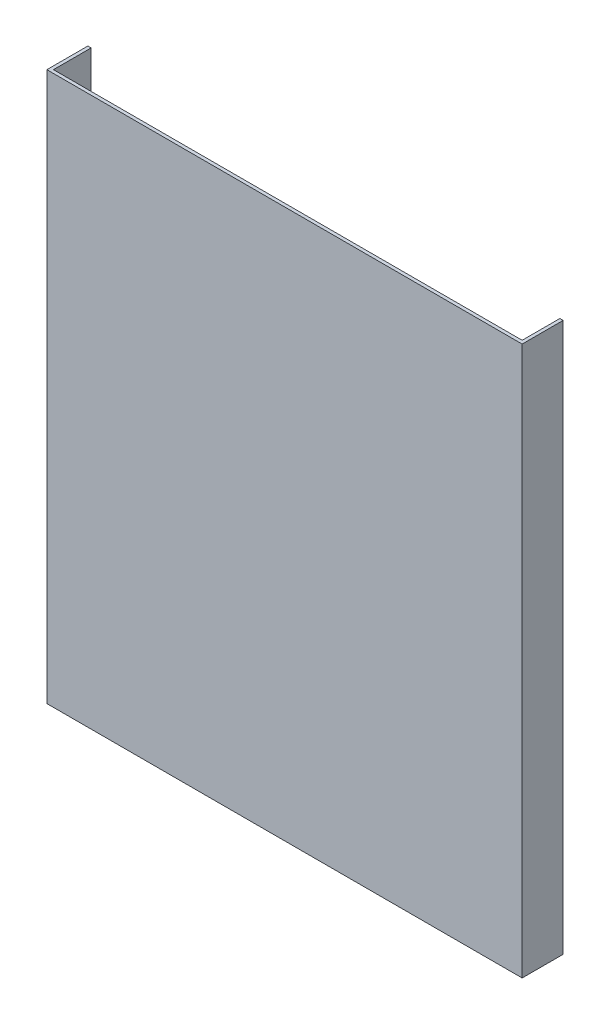
ISO-10303-21;
HEADER;
FILE_DESCRIPTION(('STEP AP214'),'2;1');
FILE_NAME('part.step','',(''),(''),'','','');
FILE_SCHEMA(('AUTOMOTIVE_DESIGN { 1 0 10303 214 1 1 1 1 }'));
ENDSEC;
DATA;
#1=APPLICATION_CONTEXT('core data for automotive mechanical design processes');
#2=APPLICATION_PROTOCOL_DEFINITION('international standard','automotive_design',2000,#1);
#3=PRODUCT_CONTEXT('',#1,'mechanical');
#4=PRODUCT('Part','Part','',(#3));
#5=PRODUCT_RELATED_PRODUCT_CATEGORY('part','',(#4));
#6=PRODUCT_DEFINITION_FORMATION('','',#4);
#7=PRODUCT_DEFINITION_CONTEXT('part definition',#1,'design');
#8=PRODUCT_DEFINITION('design','',#6,#7);
#9=PRODUCT_DEFINITION_SHAPE('','',#8);
#10=(LENGTH_UNIT() NAMED_UNIT(*) SI_UNIT(.MILLI.,.METRE.));
#11=(NAMED_UNIT(*) PLANE_ANGLE_UNIT() SI_UNIT($,.RADIAN.));
#12=(NAMED_UNIT(*) SI_UNIT($,.STERADIAN.) SOLID_ANGLE_UNIT());
#13=UNCERTAINTY_MEASURE_WITH_UNIT(LENGTH_MEASURE(1.E-05),#10,'distance_accuracy_value','');
#14=(GEOMETRIC_REPRESENTATION_CONTEXT(3) GLOBAL_UNCERTAINTY_ASSIGNED_CONTEXT((#13)) GLOBAL_UNIT_ASSIGNED_CONTEXT((#10,
#11,#12)) REPRESENTATION_CONTEXT('',''));
#15=CARTESIAN_POINT('',(0.,0.,0.));
#16=DIRECTION('',(0.,0.,1.));
#17=DIRECTION('',(1.,0.,0.));
#18=AXIS2_PLACEMENT_3D('',#15,#16,#17);
#19=CARTESIAN_POINT('',(0.,0.,0.));
#20=DIRECTION('',(0.,0.,1.));
#21=DIRECTION('',(1.,0.,0.));
#22=AXIS2_PLACEMENT_3D('',#19,#20,#21);
#23=PLANE('',#22);
#24=DIRECTION('',(0.,1.,0.));
#25=VECTOR('',#24,1.);
#26=CARTESIAN_POINT('',(174.409495548961,-273.041543026706,0.));
#27=LINE('',#26,#25);
#28=CARTESIAN_POINT('',(174.409495548961,-273.041543026706,0.));
#29=VERTEX_POINT('',#28);
#30=CARTESIAN_POINT('',(174.409495548961,61.9584569732937,0.));
#31=VERTEX_POINT('',#30);
#32=EDGE_CURVE('E129',#29,#31,#27,.T.);
#33=ORIENTED_EDGE('',*,*,#32,.F.);
#34=DIRECTION('',(1.,0.,0.));
#35=VECTOR('',#34,1.);
#36=CARTESIAN_POINT('',(-113.590504451039,-273.041543026706,0.));
#37=LINE('',#36,#35);
#38=CARTESIAN_POINT('',(-111.590504451039,-273.041543026706,0.));
#39=VERTEX_POINT('',#38);
#40=EDGE_CURVE('E168',#39,#29,#37,.T.);
#41=ORIENTED_EDGE('',*,*,#40,.F.);
#42=DIRECTION('',(0.,-1.,0.));
#43=VECTOR('',#42,1.);
#44=CARTESIAN_POINT('',(-111.590504451039,61.9584569732937,0.));
#45=LINE('',#44,#43);
#46=CARTESIAN_POINT('',(-111.590504451039,61.9584569732937,0.));
#47=VERTEX_POINT('',#46);
#48=EDGE_CURVE('E142',#47,#39,#45,.T.);
#49=ORIENTED_EDGE('',*,*,#48,.F.);
#50=DIRECTION('',(-1.,0.,0.));
#51=VECTOR('',#50,1.);
#52=CARTESIAN_POINT('',(-113.590504451039,61.9584569732937,0.));
#53=LINE('',#52,#51);
#54=EDGE_CURVE('E60',#31,#47,#53,.T.);
#55=ORIENTED_EDGE('',*,*,#54,.F.);
#56=EDGE_LOOP('',(#33,#41,#49,#55));
#57=FACE_BOUND('',#56,.T.);
#58=ADVANCED_FACE('F39',(#57),#23,.F.);
#59=CARTESIAN_POINT('',(-113.590504451039,61.9584569732937,2.));
#60=DIRECTION('',(1.,0.,0.));
#61=DIRECTION('',(0.,1.,0.));
#62=AXIS2_PLACEMENT_3D('',#59,#60,#61);
#63=PLANE('',#62);
#64=DIRECTION('',(0.,0.,-1.));
#65=VECTOR('',#64,1.);
#66=CARTESIAN_POINT('',(-113.590504451039,61.9584569732937,2.));
#67=LINE('',#66,#65);
#68=CARTESIAN_POINT('',(-113.590504451039,61.9584569732937,2.));
#69=VERTEX_POINT('',#68);
#70=CARTESIAN_POINT('',(-113.590504451039,61.9584569732937,-23.));
#71=VERTEX_POINT('',#70);
#72=EDGE_CURVE('E181',#69,#71,#67,.T.);
#73=ORIENTED_EDGE('',*,*,#72,.T.);
#74=DIRECTION('',(0.,1.,0.));
#75=VECTOR('',#74,1.);
#76=CARTESIAN_POINT('',(-113.590504451039,61.9584569732937,-23.));
#77=LINE('',#76,#75);
#78=CARTESIAN_POINT('',(-113.590504451039,-273.041543026706,-23.));
#79=VERTEX_POINT('',#78);
#80=EDGE_CURVE('E143',#79,#71,#77,.T.);
#81=ORIENTED_EDGE('',*,*,#80,.F.);
#82=DIRECTION('',(0.,0.,-1.));
#83=VECTOR('',#82,1.);
#84=CARTESIAN_POINT('',(-113.590504451039,-273.041543026706,2.));
#85=LINE('',#84,#83);
#86=CARTESIAN_POINT('',(-113.590504451039,-273.041543026706,2.));
#87=VERTEX_POINT('',#86);
#88=EDGE_CURVE('E11',#87,#79,#85,.T.);
#89=ORIENTED_EDGE('',*,*,#88,.F.);
#90=DIRECTION('',(0.,-1.,0.));
#91=VECTOR('',#90,1.);
#92=CARTESIAN_POINT('',(-113.590504451039,61.9584569732937,2.));
#93=LINE('',#92,#91);
#94=EDGE_CURVE('E169',#69,#87,#93,.T.);
#95=ORIENTED_EDGE('',*,*,#94,.F.);
#96=EDGE_LOOP('',(#73,#81,#89,#95));
#97=FACE_BOUND('',#96,.T.);
#98=ADVANCED_FACE('F41',(#97),#63,.F.);
#99=CARTESIAN_POINT('',(-113.590504451039,-273.041543026706,2.));
#100=DIRECTION('',(0.,1.,0.));
#101=DIRECTION('',(0.,0.,1.));
#102=AXIS2_PLACEMENT_3D('',#99,#100,#101);
#103=PLANE('',#102);
#104=ORIENTED_EDGE('',*,*,#88,.T.);
#105=DIRECTION('',(-1.,0.,0.));
#106=VECTOR('',#105,1.);
#107=CARTESIAN_POINT('',(-113.590504451039,-273.041543026706,-23.));
#108=LINE('',#107,#106);
#109=CARTESIAN_POINT('',(-111.590504451039,-273.041543026706,-23.));
#110=VERTEX_POINT('',#109);
#111=EDGE_CURVE('E153',#110,#79,#108,.T.);
#112=ORIENTED_EDGE('',*,*,#111,.F.);
#113=DIRECTION('',(0.,0.,1.));
#114=VECTOR('',#113,1.);
#115=CARTESIAN_POINT('',(-111.590504451039,-273.041543026706,-23.));
#116=LINE('',#115,#114);
#117=EDGE_CURVE('E157',#110,#39,#116,.T.);
#118=ORIENTED_EDGE('',*,*,#117,.T.);
#119=ORIENTED_EDGE('',*,*,#40,.T.);
#120=DIRECTION('',(0.,0.,1.));
#121=VECTOR('',#120,1.);
#122=CARTESIAN_POINT('',(174.409495548961,-273.041543026706,-23.));
#123=LINE('',#122,#121);
#124=CARTESIAN_POINT('',(174.409495548961,-273.041543026706,-23.));
#125=VERTEX_POINT('',#124);
#126=EDGE_CURVE('E119',#125,#29,#123,.T.);
#127=ORIENTED_EDGE('',*,*,#126,.F.);
#128=DIRECTION('',(-1.,0.,0.));
#129=VECTOR('',#128,1.);
#130=CARTESIAN_POINT('',(176.409495548961,-273.041543026706,-23.));
#131=LINE('',#130,#129);
#132=CARTESIAN_POINT('',(176.409495548961,-273.041543026706,-23.));
#133=VERTEX_POINT('',#132);
#134=EDGE_CURVE('E116',#133,#125,#131,.T.);
#135=ORIENTED_EDGE('',*,*,#134,.F.);
#136=DIRECTION('',(0.,0.,-1.));
#137=VECTOR('',#136,1.);
#138=CARTESIAN_POINT('',(176.409495548961,-273.041543026706,2.));
#139=LINE('',#138,#137);
#140=CARTESIAN_POINT('',(176.409495548961,-273.041543026706,2.));
#141=VERTEX_POINT('',#140);
#142=EDGE_CURVE('E48',#141,#133,#139,.T.);
#143=ORIENTED_EDGE('',*,*,#142,.F.);
#144=DIRECTION('',(1.,0.,0.));
#145=VECTOR('',#144,1.);
#146=CARTESIAN_POINT('',(-113.590504451039,-273.041543026706,2.));
#147=LINE('',#146,#145);
#148=EDGE_CURVE('E173',#87,#141,#147,.T.);
#149=ORIENTED_EDGE('',*,*,#148,.F.);
#150=EDGE_LOOP('',(#104,#112,#118,#119,#127,#135,#143,#149));
#151=FACE_BOUND('',#150,.T.);
#152=ADVANCED_FACE('F117',(#151),#103,.F.);
#153=CARTESIAN_POINT('',(176.409495548961,61.9584569732937,2.));
#154=DIRECTION('',(-1.,0.,0.));
#155=DIRECTION('',(0.,-1.,0.));
#156=AXIS2_PLACEMENT_3D('',#153,#154,#155);
#157=PLANE('',#156);
#158=ORIENTED_EDGE('',*,*,#142,.T.);
#159=DIRECTION('',(0.,-1.,0.));
#160=VECTOR('',#159,1.);
#161=CARTESIAN_POINT('',(176.409495548961,-273.041543026706,-23.));
#162=LINE('',#161,#160);
#163=CARTESIAN_POINT('',(176.409495548961,61.9584569732937,-23.));
#164=VERTEX_POINT('',#163);
#165=EDGE_CURVE('E110',#164,#133,#162,.T.);
#166=ORIENTED_EDGE('',*,*,#165,.F.);
#167=DIRECTION('',(0.,0.,-1.));
#168=VECTOR('',#167,1.);
#169=CARTESIAN_POINT('',(176.409495548961,61.9584569732937,2.));
#170=LINE('',#169,#168);
#171=CARTESIAN_POINT('',(176.409495548961,61.9584569732937,2.));
#172=VERTEX_POINT('',#171);
#173=EDGE_CURVE('E114',#172,#164,#170,.T.);
#174=ORIENTED_EDGE('',*,*,#173,.F.);
#175=DIRECTION('',(0.,1.,0.));
#176=VECTOR('',#175,1.);
#177=CARTESIAN_POINT('',(176.409495548961,61.9584569732937,2.));
#178=LINE('',#177,#176);
#179=EDGE_CURVE('E111',#141,#172,#178,.T.);
#180=ORIENTED_EDGE('',*,*,#179,.F.);
#181=EDGE_LOOP('',(#158,#166,#174,#180));
#182=FACE_BOUND('',#181,.T.);
#183=ADVANCED_FACE('F107',(#182),#157,.F.);
#184=CARTESIAN_POINT('',(-113.590504451039,61.9584569732937,2.));
#185=DIRECTION('',(0.,-1.,0.));
#186=DIRECTION('',(0.,0.,-1.));
#187=AXIS2_PLACEMENT_3D('',#184,#185,#186);
#188=PLANE('',#187);
#189=ORIENTED_EDGE('',*,*,#173,.T.);
#190=DIRECTION('',(1.,0.,0.));
#191=VECTOR('',#190,1.);
#192=CARTESIAN_POINT('',(176.409495548961,61.9584569732937,-23.));
#193=LINE('',#192,#191);
#194=CARTESIAN_POINT('',(174.409495548961,61.9584569732937,-23.));
#195=VERTEX_POINT('',#194);
#196=EDGE_CURVE('E127',#195,#164,#193,.T.);
#197=ORIENTED_EDGE('',*,*,#196,.F.);
#198=DIRECTION('',(0.,0.,1.));
#199=VECTOR('',#198,1.);
#200=CARTESIAN_POINT('',(174.409495548961,61.9584569732937,-23.));
#201=LINE('',#200,#199);
#202=EDGE_CURVE('E55',#195,#31,#201,.T.);
#203=ORIENTED_EDGE('',*,*,#202,.T.);
#204=ORIENTED_EDGE('',*,*,#54,.T.);
#205=DIRECTION('',(0.,0.,1.));
#206=VECTOR('',#205,1.);
#207=CARTESIAN_POINT('',(-111.590504451039,61.9584569732937,-23.));
#208=LINE('',#207,#206);
#209=CARTESIAN_POINT('',(-111.590504451039,61.9584569732937,-23.));
#210=VERTEX_POINT('',#209);
#211=EDGE_CURVE('E164',#210,#47,#208,.T.);
#212=ORIENTED_EDGE('',*,*,#211,.F.);
#213=DIRECTION('',(1.,0.,0.));
#214=VECTOR('',#213,1.);
#215=CARTESIAN_POINT('',(-113.590504451039,61.9584569732937,-23.));
#216=LINE('',#215,#214);
#217=EDGE_CURVE('E147',#71,#210,#216,.T.);
#218=ORIENTED_EDGE('',*,*,#217,.F.);
#219=ORIENTED_EDGE('',*,*,#72,.F.);
#220=DIRECTION('',(-1.,0.,0.));
#221=VECTOR('',#220,1.);
#222=CARTESIAN_POINT('',(-113.590504451039,61.9584569732937,2.));
#223=LINE('',#222,#221);
#224=EDGE_CURVE('E178',#172,#69,#223,.T.);
#225=ORIENTED_EDGE('',*,*,#224,.F.);
#226=EDGE_LOOP('',(#189,#197,#203,#204,#212,#218,#219,#225));
#227=FACE_BOUND('',#226,.T.);
#228=ADVANCED_FACE('F190',(#227),#188,.F.);
#229=CARTESIAN_POINT('',(0.,0.,2.));
#230=DIRECTION('',(0.,0.,1.));
#231=DIRECTION('',(1.,0.,0.));
#232=AXIS2_PLACEMENT_3D('',#229,#230,#231);
#233=PLANE('',#232);
#234=ORIENTED_EDGE('',*,*,#94,.T.);
#235=ORIENTED_EDGE('',*,*,#148,.T.);
#236=ORIENTED_EDGE('',*,*,#179,.T.);
#237=ORIENTED_EDGE('',*,*,#224,.T.);
#238=EDGE_LOOP('',(#234,#235,#236,#237));
#239=FACE_BOUND('',#238,.T.);
#240=ADVANCED_FACE('F195',(#239),#233,.T.);
#241=CARTESIAN_POINT('',(-111.590504451039,61.9584569732937,-23.));
#242=DIRECTION('',(-1.,0.,0.));
#243=DIRECTION('',(0.,-1.,0.));
#244=AXIS2_PLACEMENT_3D('',#241,#242,#243);
#245=PLANE('',#244);
#246=ORIENTED_EDGE('',*,*,#48,.T.);
#247=ORIENTED_EDGE('',*,*,#117,.F.);
#248=DIRECTION('',(0.,-1.,0.));
#249=VECTOR('',#248,1.);
#250=CARTESIAN_POINT('',(-111.590504451039,61.9584569732937,-23.));
#251=LINE('',#250,#249);
#252=EDGE_CURVE('E150',#210,#110,#251,.T.);
#253=ORIENTED_EDGE('',*,*,#252,.F.);
#254=ORIENTED_EDGE('',*,*,#211,.T.);
#255=EDGE_LOOP('',(#246,#247,#253,#254));
#256=FACE_BOUND('',#255,.T.);
#257=ADVANCED_FACE('F205',(#256),#245,.F.);
#258=CARTESIAN_POINT('',(0.,0.,-23.));
#259=DIRECTION('',(0.,0.,1.));
#260=DIRECTION('',(1.,0.,0.));
#261=AXIS2_PLACEMENT_3D('',#258,#259,#260);
#262=PLANE('',#261);
#263=ORIENTED_EDGE('',*,*,#80,.T.);
#264=ORIENTED_EDGE('',*,*,#217,.T.);
#265=ORIENTED_EDGE('',*,*,#252,.T.);
#266=ORIENTED_EDGE('',*,*,#111,.T.);
#267=EDGE_LOOP('',(#263,#264,#265,#266));
#268=FACE_BOUND('',#267,.T.);
#269=ADVANCED_FACE('F201',(#268),#262,.F.);
#270=CARTESIAN_POINT('',(174.409495548961,-273.041543026706,-23.));
#271=DIRECTION('',(1.,0.,0.));
#272=DIRECTION('',(0.,1.,0.));
#273=AXIS2_PLACEMENT_3D('',#270,#271,#272);
#274=PLANE('',#273);
#275=ORIENTED_EDGE('',*,*,#32,.T.);
#276=ORIENTED_EDGE('',*,*,#202,.F.);
#277=DIRECTION('',(0.,1.,0.));
#278=VECTOR('',#277,1.);
#279=CARTESIAN_POINT('',(174.409495548961,-273.041543026706,-23.));
#280=LINE('',#279,#278);
#281=EDGE_CURVE('E123',#125,#195,#280,.T.);
#282=ORIENTED_EDGE('',*,*,#281,.F.);
#283=ORIENTED_EDGE('',*,*,#126,.T.);
#284=EDGE_LOOP('',(#275,#276,#282,#283));
#285=FACE_BOUND('',#284,.T.);
#286=ADVANCED_FACE('F209',(#285),#274,.F.);
#287=CARTESIAN_POINT('',(0.,0.,-23.));
#288=DIRECTION('',(0.,0.,1.));
#289=DIRECTION('',(1.,0.,0.));
#290=AXIS2_PLACEMENT_3D('',#287,#288,#289);
#291=PLANE('',#290);
#292=ORIENTED_EDGE('',*,*,#165,.T.);
#293=ORIENTED_EDGE('',*,*,#134,.T.);
#294=ORIENTED_EDGE('',*,*,#281,.T.);
#295=ORIENTED_EDGE('',*,*,#196,.T.);
#296=EDGE_LOOP('',(#292,#293,#294,#295));
#297=FACE_BOUND('',#296,.T.);
#298=ADVANCED_FACE('F126',(#297),#291,.F.);
#299=CLOSED_SHELL('',(#58,#98,#152,#183,#228,#240,#257,#269,#286,#298));
#300=MANIFOLD_SOLID_BREP('B2',#299);
#301=ADVANCED_BREP_SHAPE_REPRESENTATION('',(#18,#300),#14);
#302=SHAPE_DEFINITION_REPRESENTATION(#9,#301);
ENDSEC;
END-ISO-10303-21;
